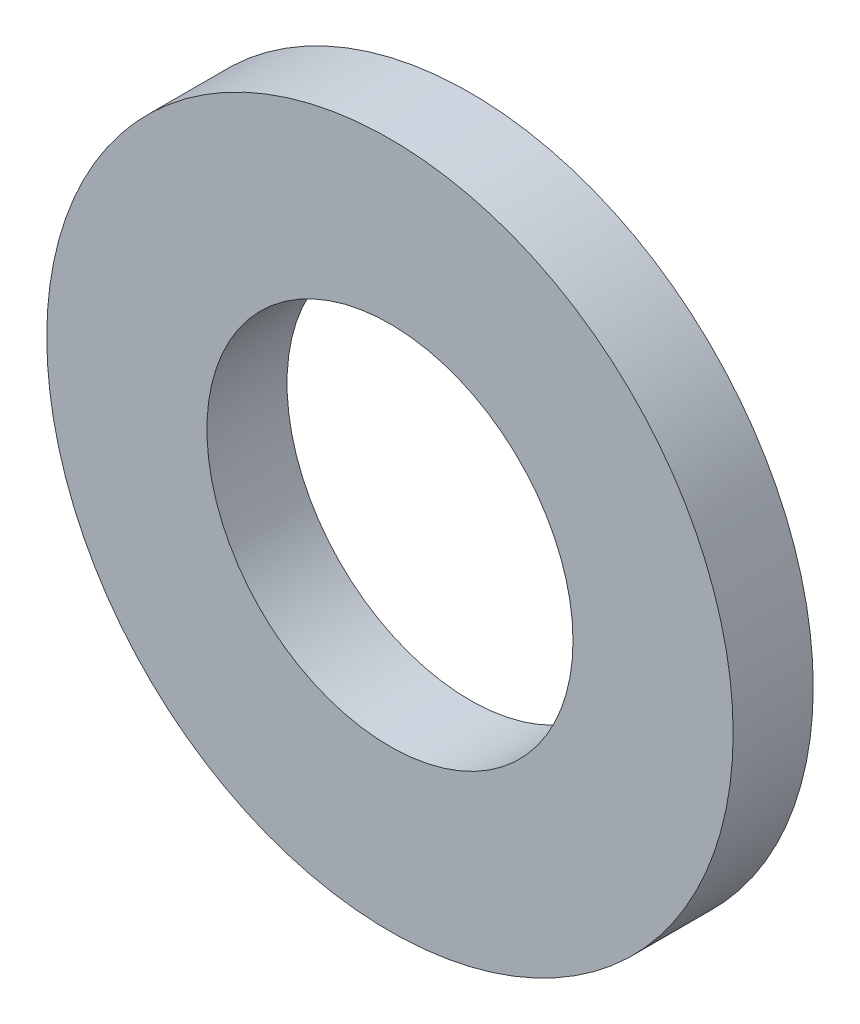
ISO-10303-21;
HEADER;
FILE_DESCRIPTION(('STEP AP214'),'2;1');
FILE_NAME('part.step','',(''),(''),'','','');
FILE_SCHEMA(('AUTOMOTIVE_DESIGN { 1 0 10303 214 1 1 1 1 }'));
ENDSEC;
DATA;
#1=APPLICATION_CONTEXT('core data for automotive mechanical design processes');
#2=APPLICATION_PROTOCOL_DEFINITION('international standard','automotive_design',2000,#1);
#3=PRODUCT_CONTEXT('',#1,'mechanical');
#4=PRODUCT('Part','Part','',(#3));
#5=PRODUCT_RELATED_PRODUCT_CATEGORY('part','',(#4));
#6=PRODUCT_DEFINITION_FORMATION('','',#4);
#7=PRODUCT_DEFINITION_CONTEXT('part definition',#1,'design');
#8=PRODUCT_DEFINITION('design','',#6,#7);
#9=PRODUCT_DEFINITION_SHAPE('','',#8);
#10=(LENGTH_UNIT() NAMED_UNIT(*) SI_UNIT(.MILLI.,.METRE.));
#11=(NAMED_UNIT(*) PLANE_ANGLE_UNIT() SI_UNIT($,.RADIAN.));
#12=(NAMED_UNIT(*) SI_UNIT($,.STERADIAN.) SOLID_ANGLE_UNIT());
#13=UNCERTAINTY_MEASURE_WITH_UNIT(LENGTH_MEASURE(1.E-05),#10,'distance_accuracy_value','');
#14=(GEOMETRIC_REPRESENTATION_CONTEXT(3) GLOBAL_UNCERTAINTY_ASSIGNED_CONTEXT((#13)) GLOBAL_UNIT_ASSIGNED_CONTEXT((#10,
#11,#12)) REPRESENTATION_CONTEXT('',''));
#15=CARTESIAN_POINT('',(0.,0.,0.));
#16=DIRECTION('',(0.,0.,1.));
#17=DIRECTION('',(1.,0.,0.));
#18=AXIS2_PLACEMENT_3D('',#15,#16,#17);
#19=CARTESIAN_POINT('',(0.,0.,-1.4));
#20=DIRECTION('',(0.,0.,1.));
#21=DIRECTION('',(1.,0.,0.));
#22=AXIS2_PLACEMENT_3D('',#19,#20,#21);
#23=CYLINDRICAL_SURFACE('',#22,6.);
#24=CARTESIAN_POINT('',(0.,0.,-1.4));
#25=DIRECTION('',(0.,0.,1.));
#26=DIRECTION('',(1.,0.,0.));
#27=AXIS2_PLACEMENT_3D('',#24,#25,#26);
#28=CIRCLE('',#27,6.);
#29=CARTESIAN_POINT('',(6.,0.,-1.4));
#30=VERTEX_POINT('',#29);
#31=EDGE_CURVE('E10',#30,#30,#28,.T.);
#32=ORIENTED_EDGE('',*,*,#31,.T.);
#33=EDGE_LOOP('',(#32));
#34=FACE_BOUND('',#33,.T.);
#35=CARTESIAN_POINT('',(0.,0.,0.));
#36=DIRECTION('',(0.,0.,1.));
#37=DIRECTION('',(1.,0.,0.));
#38=AXIS2_PLACEMENT_3D('',#35,#36,#37);
#39=CIRCLE('',#38,6.);
#40=CARTESIAN_POINT('',(6.,0.,0.));
#41=VERTEX_POINT('',#40);
#42=EDGE_CURVE('E31',#41,#41,#39,.T.);
#43=ORIENTED_EDGE('',*,*,#42,.F.);
#44=EDGE_LOOP('',(#43));
#45=FACE_BOUND('',#44,.T.);
#46=ADVANCED_FACE('F28',(#34,#45),#23,.T.);
#47=CARTESIAN_POINT('',(0.,0.,-1.4));
#48=DIRECTION('',(0.,0.,1.));
#49=DIRECTION('',(1.,0.,0.));
#50=AXIS2_PLACEMENT_3D('',#47,#48,#49);
#51=PLANE('',#50);
#52=CARTESIAN_POINT('',(0.,0.,-1.4));
#53=DIRECTION('',(0.,0.,1.));
#54=DIRECTION('',(1.,0.,0.));
#55=AXIS2_PLACEMENT_3D('',#52,#53,#54);
#56=CIRCLE('',#55,3.2);
#57=CARTESIAN_POINT('',(3.2,0.,-1.4));
#58=VERTEX_POINT('',#57);
#59=EDGE_CURVE('E38',#58,#58,#56,.T.);
#60=ORIENTED_EDGE('',*,*,#59,.T.);
#61=EDGE_LOOP('',(#60));
#62=FACE_BOUND('',#61,.T.);
#63=ORIENTED_EDGE('',*,*,#31,.F.);
#64=EDGE_LOOP('',(#63));
#65=FACE_BOUND('',#64,.T.);
#66=ADVANCED_FACE('F46',(#62,#65),#51,.F.);
#67=CARTESIAN_POINT('',(0.,0.,0.));
#68=DIRECTION('',(0.,0.,1.));
#69=DIRECTION('',(1.,0.,0.));
#70=AXIS2_PLACEMENT_3D('',#67,#68,#69);
#71=PLANE('',#70);
#72=CARTESIAN_POINT('',(0.,0.,0.));
#73=DIRECTION('',(0.,0.,1.));
#74=DIRECTION('',(1.,0.,0.));
#75=AXIS2_PLACEMENT_3D('',#72,#73,#74);
#76=CIRCLE('',#75,3.2);
#77=CARTESIAN_POINT('',(3.2,0.,0.));
#78=VERTEX_POINT('',#77);
#79=EDGE_CURVE('E40',#78,#78,#76,.T.);
#80=ORIENTED_EDGE('',*,*,#79,.F.);
#81=EDGE_LOOP('',(#80));
#82=FACE_BOUND('',#81,.T.);
#83=ORIENTED_EDGE('',*,*,#42,.T.);
#84=EDGE_LOOP('',(#83));
#85=FACE_BOUND('',#84,.T.);
#86=ADVANCED_FACE('F52',(#82,#85),#71,.T.);
#87=CARTESIAN_POINT('',(0.,0.,-1.4));
#88=DIRECTION('',(0.,0.,1.));
#89=DIRECTION('',(1.,0.,0.));
#90=AXIS2_PLACEMENT_3D('',#87,#88,#89);
#91=CYLINDRICAL_SURFACE('',#90,3.2);
#92=ORIENTED_EDGE('',*,*,#59,.F.);
#93=EDGE_LOOP('',(#92));
#94=FACE_BOUND('',#93,.T.);
#95=ORIENTED_EDGE('',*,*,#79,.T.);
#96=EDGE_LOOP('',(#95));
#97=FACE_BOUND('',#96,.T.);
#98=ADVANCED_FACE('F49',(#94,#97),#91,.F.);
#99=CLOSED_SHELL('',(#46,#66,#86,#98));
#100=MANIFOLD_SOLID_BREP('B2',#99);
#101=ADVANCED_BREP_SHAPE_REPRESENTATION('',(#18,#100),#14);
#102=SHAPE_DEFINITION_REPRESENTATION(#9,#101);
ENDSEC;
END-ISO-10303-21;
